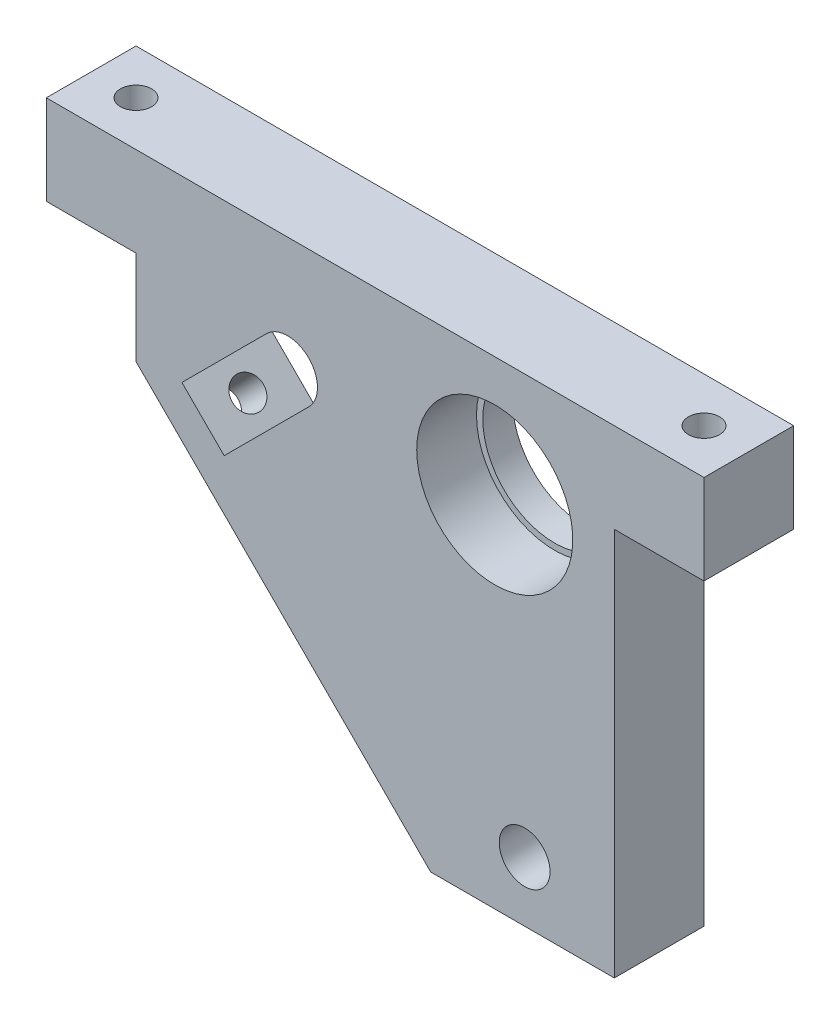
ISO-10303-21;
HEADER;
FILE_DESCRIPTION(('STEP AP214'),'2;1');
FILE_NAME('part.step','',(''),(''),'','','');
FILE_SCHEMA(('AUTOMOTIVE_DESIGN { 1 0 10303 214 1 1 1 1 }'));
ENDSEC;
DATA;
#1=APPLICATION_CONTEXT('core data for automotive mechanical design processes');
#2=APPLICATION_PROTOCOL_DEFINITION('international standard','automotive_design',2000,#1);
#3=PRODUCT_CONTEXT('',#1,'mechanical');
#4=PRODUCT('Part','Part','',(#3));
#5=PRODUCT_RELATED_PRODUCT_CATEGORY('part','',(#4));
#6=PRODUCT_DEFINITION_FORMATION('','',#4);
#7=PRODUCT_DEFINITION_CONTEXT('part definition',#1,'design');
#8=PRODUCT_DEFINITION('design','',#6,#7);
#9=PRODUCT_DEFINITION_SHAPE('','',#8);
#10=(LENGTH_UNIT() NAMED_UNIT(*) SI_UNIT(.MILLI.,.METRE.));
#11=(NAMED_UNIT(*) PLANE_ANGLE_UNIT() SI_UNIT($,.RADIAN.));
#12=(NAMED_UNIT(*) SI_UNIT($,.STERADIAN.) SOLID_ANGLE_UNIT());
#13=UNCERTAINTY_MEASURE_WITH_UNIT(LENGTH_MEASURE(1.E-05),#10,'distance_accuracy_value','');
#14=(GEOMETRIC_REPRESENTATION_CONTEXT(3) GLOBAL_UNCERTAINTY_ASSIGNED_CONTEXT((#13)) GLOBAL_UNIT_ASSIGNED_CONTEXT((#10,
#11,#12)) REPRESENTATION_CONTEXT('',''));
#15=CARTESIAN_POINT('',(0.,0.,0.));
#16=DIRECTION('',(0.,0.,1.));
#17=DIRECTION('',(1.,0.,0.));
#18=AXIS2_PLACEMENT_3D('',#15,#16,#17);
#19=CARTESIAN_POINT('',(0.,0.,15.));
#20=DIRECTION('',(0.,0.,1.));
#21=DIRECTION('',(1.,0.,0.));
#22=AXIS2_PLACEMENT_3D('',#19,#20,#21);
#23=PLANE('',#22);
#24=CARTESIAN_POINT('',(41.1990103270224,21.3834982788296,15.));
#25=DIRECTION('',(0.,0.,-1.));
#26=DIRECTION('',(-1.,0.,0.));
#27=AXIS2_PLACEMENT_3D('',#24,#25,#26);
#28=CIRCLE('',#27,13.05);
#29=CARTESIAN_POINT('',(28.1490103270224,21.3834982788296,15.));
#30=VERTEX_POINT('',#29);
#31=EDGE_CURVE('E241',#30,#30,#28,.T.);
#32=ORIENTED_EDGE('',*,*,#31,.T.);
#33=EDGE_LOOP('',(#32));
#34=FACE_BOUND('',#33,.T.);
#35=DIRECTION('',(0.707106781186548,0.707106781186547,0.));
#36=VECTOR('',#35,1.);
#37=CARTESIAN_POINT('',(-4.05582366891658,4.41293553035247,15.));
#38=LINE('',#37,#36);
#39=CARTESIAN_POINT('',(-4.05582366891658,4.41293553035247,15.));
#40=VERTEX_POINT('',#39);
#41=CARTESIAN_POINT('',(10.0863119548146,18.5550711540836,15.));
#42=VERTEX_POINT('',#41);
#43=EDGE_CURVE('E139',#40,#42,#38,.T.);
#44=ORIENTED_EDGE('',*,*,#43,.F.);
#45=DIRECTION('',(0.707106781186546,-0.707106781186549,0.));
#46=VECTOR('',#45,1.);
#47=CARTESIAN_POINT('',(-11.1268914807821,11.484003342218,15.));
#48=LINE('',#47,#46);
#49=CARTESIAN_POINT('',(-11.1268914807821,11.484003342218,15.));
#50=VERTEX_POINT('',#49);
#51=EDGE_CURVE('E131',#50,#40,#48,.T.);
#52=ORIENTED_EDGE('',*,*,#51,.F.);
#53=DIRECTION('',(-0.707106781186548,-0.707106781186547,0.));
#54=VECTOR('',#53,1.);
#55=CARTESIAN_POINT('',(-11.1268914807821,11.484003342218,15.));
#56=LINE('',#55,#54);
#57=CARTESIAN_POINT('',(3.01524414294889,25.6261389659489,15.));
#58=VERTEX_POINT('',#57);
#59=EDGE_CURVE('E154',#58,#50,#56,.T.);
#60=ORIENTED_EDGE('',*,*,#59,.F.);
#61=CARTESIAN_POINT('',(6.55077804888163,22.0906050600162,15.));
#62=DIRECTION('',(0.,0.,1.));
#63=DIRECTION('',(1.,0.,0.));
#64=AXIS2_PLACEMENT_3D('',#61,#62,#63);
#65=CIRCLE('',#64,5.00000000000001);
#66=EDGE_CURVE('E152',#42,#58,#65,.T.);
#67=ORIENTED_EDGE('',*,*,#66,.F.);
#68=EDGE_LOOP('',(#44,#52,#60,#67));
#69=FACE_BOUND('',#68,.T.);
#70=DIRECTION('',(0.,-1.,0.));
#71=VECTOR('',#70,1.);
#72=CARTESIAN_POINT('',(-33.8009896729777,41.3834982788296,15.));
#73=LINE('',#72,#71);
#74=CARTESIAN_POINT('',(-33.8009896729777,41.3834982788296,15.));
#75=VERTEX_POINT('',#74);
#76=CARTESIAN_POINT('',(-33.8009896729777,26.3834982788296,15.));
#77=VERTEX_POINT('',#76);
#78=EDGE_CURVE('E173',#75,#77,#73,.T.);
#79=ORIENTED_EDGE('',*,*,#78,.T.);
#80=DIRECTION('',(1.,0.,0.));
#81=VECTOR('',#80,1.);
#82=CARTESIAN_POINT('',(-33.8009896729777,26.3834982788296,15.));
#83=LINE('',#82,#81);
#84=CARTESIAN_POINT('',(-18.8009896729777,26.3834982788296,15.));
#85=VERTEX_POINT('',#84);
#86=EDGE_CURVE('E176',#77,#85,#83,.T.);
#87=ORIENTED_EDGE('',*,*,#86,.T.);
#88=DIRECTION('',(0.,-1.,0.));
#89=VECTOR('',#88,1.);
#90=CARTESIAN_POINT('',(-18.8009896729777,26.3834982788296,15.));
#91=LINE('',#90,#89);
#92=CARTESIAN_POINT('',(-18.8009896729777,10.672820160175,15.));
#93=VERTEX_POINT('',#92);
#94=EDGE_CURVE('E179',#85,#93,#91,.T.);
#95=ORIENTED_EDGE('',*,*,#94,.T.);
#96=DIRECTION('',(0.707106781186546,-0.707106781186549,0.));
#97=VECTOR('',#96,1.);
#98=CARTESIAN_POINT('',(-18.8009896729777,10.672820160175,15.));
#99=LINE('',#98,#97);
#100=CARTESIAN_POINT('',(30.4883322083676,-38.6165017211704,15.));
#101=VERTEX_POINT('',#100);
#102=EDGE_CURVE('E181',#93,#101,#99,.T.);
#103=ORIENTED_EDGE('',*,*,#102,.T.);
#104=DIRECTION('',(1.,0.,0.));
#105=VECTOR('',#104,1.);
#106=CARTESIAN_POINT('',(30.4883322083676,-38.6165017211704,15.));
#107=LINE('',#106,#105);
#108=CARTESIAN_POINT('',(61.1990103270224,-38.6165017211704,15.));
#109=VERTEX_POINT('',#108);
#110=EDGE_CURVE('E183',#101,#109,#107,.T.);
#111=ORIENTED_EDGE('',*,*,#110,.T.);
#112=DIRECTION('',(0.,1.,0.));
#113=VECTOR('',#112,1.);
#114=CARTESIAN_POINT('',(61.1990103270224,26.3834982788296,15.));
#115=LINE('',#114,#113);
#116=CARTESIAN_POINT('',(61.1990103270224,26.3834982788296,15.));
#117=VERTEX_POINT('',#116);
#118=EDGE_CURVE('E185',#109,#117,#115,.T.);
#119=ORIENTED_EDGE('',*,*,#118,.T.);
#120=DIRECTION('',(1.,0.,0.));
#121=VECTOR('',#120,1.);
#122=CARTESIAN_POINT('',(76.1990103270224,26.3834982788296,15.));
#123=LINE('',#122,#121);
#124=CARTESIAN_POINT('',(76.1990103270224,26.3834982788296,15.));
#125=VERTEX_POINT('',#124);
#126=EDGE_CURVE('E187',#117,#125,#123,.T.);
#127=ORIENTED_EDGE('',*,*,#126,.T.);
#128=DIRECTION('',(0.,1.,0.));
#129=VECTOR('',#128,1.);
#130=CARTESIAN_POINT('',(76.1990103270224,41.3834982788296,15.));
#131=LINE('',#130,#129);
#132=CARTESIAN_POINT('',(76.1990103270224,41.3834982788296,15.));
#133=VERTEX_POINT('',#132);
#134=EDGE_CURVE('E189',#125,#133,#131,.T.);
#135=ORIENTED_EDGE('',*,*,#134,.T.);
#136=DIRECTION('',(-1.,0.,0.));
#137=VECTOR('',#136,1.);
#138=CARTESIAN_POINT('',(56.1990103270223,41.3834982788296,15.));
#139=LINE('',#138,#137);
#140=EDGE_CURVE('E191',#133,#75,#139,.T.);
#141=ORIENTED_EDGE('',*,*,#140,.T.);
#142=EDGE_LOOP('',(#79,#87,#95,#103,#111,#119,#127,#135,#141));
#143=FACE_BOUND('',#142,.T.);
#144=CARTESIAN_POINT('',(46.1990103270224,-28.6165017211704,15.));
#145=DIRECTION('',(0.,0.,1.));
#146=DIRECTION('',(1.,0.,0.));
#147=AXIS2_PLACEMENT_3D('',#144,#145,#146);
#148=CIRCLE('',#147,4.25);
#149=CARTESIAN_POINT('',(50.4490103270224,-28.6165017211704,15.));
#150=VERTEX_POINT('',#149);
#151=EDGE_CURVE('E160',#150,#150,#148,.T.);
#152=ORIENTED_EDGE('',*,*,#151,.F.);
#153=EDGE_LOOP('',(#152));
#154=FACE_BOUND('',#153,.T.);
#155=ADVANCED_FACE('F34',(#34,#69,#143,#154),#23,.T.);
#156=CARTESIAN_POINT('',(0.,0.,0.));
#157=DIRECTION('',(0.,0.,1.));
#158=DIRECTION('',(1.,0.,0.));
#159=AXIS2_PLACEMENT_3D('',#156,#157,#158);
#160=PLANE('',#159);
#161=CARTESIAN_POINT('',(41.1990103270224,21.3834982788296,0.));
#162=DIRECTION('',(0.,0.,1.));
#163=DIRECTION('',(1.,0.,0.));
#164=AXIS2_PLACEMENT_3D('',#161,#162,#163);
#165=CIRCLE('',#164,12.);
#166=CARTESIAN_POINT('',(53.1990103270224,21.3834982788296,0.));
#167=VERTEX_POINT('',#166);
#168=EDGE_CURVE('E147',#167,#167,#165,.T.);
#169=ORIENTED_EDGE('',*,*,#168,.T.);
#170=EDGE_LOOP('',(#169));
#171=FACE_BOUND('',#170,.T.);
#172=DIRECTION('',(0.,-1.,0.));
#173=VECTOR('',#172,1.);
#174=CARTESIAN_POINT('',(-33.8009896729777,41.3834982788296,0.));
#175=LINE('',#174,#173);
#176=CARTESIAN_POINT('',(-33.8009896729777,41.3834982788296,0.));
#177=VERTEX_POINT('',#176);
#178=CARTESIAN_POINT('',(-33.8009896729777,26.3834982788296,0.));
#179=VERTEX_POINT('',#178);
#180=EDGE_CURVE('E172',#177,#179,#175,.T.);
#181=ORIENTED_EDGE('',*,*,#180,.F.);
#182=DIRECTION('',(-1.,0.,0.));
#183=VECTOR('',#182,1.);
#184=CARTESIAN_POINT('',(-33.8009896729777,41.3834982788296,0.));
#185=LINE('',#184,#183);
#186=CARTESIAN_POINT('',(76.1990103270224,41.3834982788296,0.));
#187=VERTEX_POINT('',#186);
#188=EDGE_CURVE('E177',#187,#177,#185,.T.);
#189=ORIENTED_EDGE('',*,*,#188,.F.);
#190=DIRECTION('',(0.,1.,0.));
#191=VECTOR('',#190,1.);
#192=CARTESIAN_POINT('',(76.1990103270224,41.3834982788296,0.));
#193=LINE('',#192,#191);
#194=CARTESIAN_POINT('',(76.1990103270224,26.3834982788296,0.));
#195=VERTEX_POINT('',#194);
#196=EDGE_CURVE('E208',#195,#187,#193,.T.);
#197=ORIENTED_EDGE('',*,*,#196,.F.);
#198=DIRECTION('',(1.,0.,0.));
#199=VECTOR('',#198,1.);
#200=CARTESIAN_POINT('',(76.1990103270224,26.3834982788296,0.));
#201=LINE('',#200,#199);
#202=CARTESIAN_POINT('',(61.1990103270224,26.3834982788296,0.));
#203=VERTEX_POINT('',#202);
#204=EDGE_CURVE('E206',#203,#195,#201,.T.);
#205=ORIENTED_EDGE('',*,*,#204,.F.);
#206=DIRECTION('',(0.,1.,0.));
#207=VECTOR('',#206,1.);
#208=CARTESIAN_POINT('',(61.1990103270224,26.3834982788296,0.));
#209=LINE('',#208,#207);
#210=CARTESIAN_POINT('',(61.1990103270224,-38.6165017211704,0.));
#211=VERTEX_POINT('',#210);
#212=EDGE_CURVE('E204',#211,#203,#209,.T.);
#213=ORIENTED_EDGE('',*,*,#212,.F.);
#214=DIRECTION('',(1.,0.,0.));
#215=VECTOR('',#214,1.);
#216=CARTESIAN_POINT('',(30.4883322083676,-38.6165017211704,0.));
#217=LINE('',#216,#215);
#218=CARTESIAN_POINT('',(30.4883322083676,-38.6165017211704,0.));
#219=VERTEX_POINT('',#218);
#220=EDGE_CURVE('E202',#219,#211,#217,.T.);
#221=ORIENTED_EDGE('',*,*,#220,.F.);
#222=DIRECTION('',(0.707106781186546,-0.707106781186549,0.));
#223=VECTOR('',#222,1.);
#224=CARTESIAN_POINT('',(-18.8009896729777,10.672820160175,0.));
#225=LINE('',#224,#223);
#226=CARTESIAN_POINT('',(-18.8009896729777,10.672820160175,0.));
#227=VERTEX_POINT('',#226);
#228=EDGE_CURVE('E200',#227,#219,#225,.T.);
#229=ORIENTED_EDGE('',*,*,#228,.F.);
#230=DIRECTION('',(0.,-1.,0.));
#231=VECTOR('',#230,1.);
#232=CARTESIAN_POINT('',(-18.8009896729777,26.3834982788296,0.));
#233=LINE('',#232,#231);
#234=CARTESIAN_POINT('',(-18.8009896729777,26.3834982788296,0.));
#235=VERTEX_POINT('',#234);
#236=EDGE_CURVE('E198',#235,#227,#233,.T.);
#237=ORIENTED_EDGE('',*,*,#236,.F.);
#238=DIRECTION('',(1.,0.,0.));
#239=VECTOR('',#238,1.);
#240=CARTESIAN_POINT('',(-27.4405999797669,26.3834982788296,0.));
#241=LINE('',#240,#239);
#242=EDGE_CURVE('E196',#179,#235,#241,.T.);
#243=ORIENTED_EDGE('',*,*,#242,.F.);
#244=EDGE_LOOP('',(#181,#189,#197,#205,#213,#221,#229,#237,#243));
#245=FACE_BOUND('',#244,.T.);
#246=DIRECTION('',(0.707106781186546,-0.707106781186549,0.));
#247=VECTOR('',#246,1.);
#248=CARTESIAN_POINT('',(-11.1268914807821,11.484003342218,0.));
#249=LINE('',#248,#247);
#250=CARTESIAN_POINT('',(-11.1268914807821,11.484003342218,0.));
#251=VERTEX_POINT('',#250);
#252=CARTESIAN_POINT('',(-4.05582366891658,4.41293553035247,0.));
#253=VERTEX_POINT('',#252);
#254=EDGE_CURVE('E59',#251,#253,#249,.T.);
#255=ORIENTED_EDGE('',*,*,#254,.T.);
#256=DIRECTION('',(0.707106781186548,0.707106781186547,0.));
#257=VECTOR('',#256,1.);
#258=CARTESIAN_POINT('',(-4.05582366891658,4.41293553035247,0.));
#259=LINE('',#258,#257);
#260=CARTESIAN_POINT('',(10.0863119548146,18.5550711540836,0.));
#261=VERTEX_POINT('',#260);
#262=EDGE_CURVE('E146',#253,#261,#259,.T.);
#263=ORIENTED_EDGE('',*,*,#262,.T.);
#264=CARTESIAN_POINT('',(6.55077804888163,22.0906050600162,0.));
#265=DIRECTION('',(0.,0.,1.));
#266=DIRECTION('',(1.,0.,0.));
#267=AXIS2_PLACEMENT_3D('',#264,#265,#266);
#268=CIRCLE('',#267,5.00000000000001);
#269=CARTESIAN_POINT('',(3.01524414294889,25.6261389659489,0.));
#270=VERTEX_POINT('',#269);
#271=EDGE_CURVE('E162',#261,#270,#268,.T.);
#272=ORIENTED_EDGE('',*,*,#271,.T.);
#273=DIRECTION('',(-0.707106781186548,-0.707106781186547,0.));
#274=VECTOR('',#273,1.);
#275=CARTESIAN_POINT('',(-11.1268914807821,11.484003342218,0.));
#276=LINE('',#275,#274);
#277=EDGE_CURVE('E140',#270,#251,#276,.T.);
#278=ORIENTED_EDGE('',*,*,#277,.T.);
#279=EDGE_LOOP('',(#255,#263,#272,#278));
#280=FACE_BOUND('',#279,.T.);
#281=CARTESIAN_POINT('',(46.1990103270224,-28.6165017211704,0.));
#282=DIRECTION('',(0.,0.,1.));
#283=DIRECTION('',(1.,0.,0.));
#284=AXIS2_PLACEMENT_3D('',#281,#282,#283);
#285=CIRCLE('',#284,4.25);
#286=CARTESIAN_POINT('',(50.4490103270224,-28.6165017211704,0.));
#287=VERTEX_POINT('',#286);
#288=EDGE_CURVE('E235',#287,#287,#285,.T.);
#289=ORIENTED_EDGE('',*,*,#288,.T.);
#290=EDGE_LOOP('',(#289));
#291=FACE_BOUND('',#290,.T.);
#292=ADVANCED_FACE('F258',(#171,#245,#280,#291),#160,.F.);
#293=CARTESIAN_POINT('',(-33.8009896729777,41.3834982788296,15.));
#294=DIRECTION('',(1.,0.,0.));
#295=DIRECTION('',(0.,1.,0.));
#296=AXIS2_PLACEMENT_3D('',#293,#294,#295);
#297=PLANE('',#296);
#298=ORIENTED_EDGE('',*,*,#180,.T.);
#299=DIRECTION('',(0.,0.,-1.));
#300=VECTOR('',#299,1.);
#301=CARTESIAN_POINT('',(-33.8009896729777,26.3834982788296,15.));
#302=LINE('',#301,#300);
#303=EDGE_CURVE('E11',#77,#179,#302,.T.);
#304=ORIENTED_EDGE('',*,*,#303,.F.);
#305=ORIENTED_EDGE('',*,*,#78,.F.);
#306=DIRECTION('',(0.,0.,-1.));
#307=VECTOR('',#306,1.);
#308=CARTESIAN_POINT('',(-33.8009896729777,41.3834982788296,15.));
#309=LINE('',#308,#307);
#310=EDGE_CURVE('E193',#75,#177,#309,.T.);
#311=ORIENTED_EDGE('',*,*,#310,.T.);
#312=EDGE_LOOP('',(#298,#304,#305,#311));
#313=FACE_BOUND('',#312,.T.);
#314=ADVANCED_FACE('F36',(#313),#297,.F.);
#315=CARTESIAN_POINT('',(-27.4405999797669,26.3834982788296,15.));
#316=DIRECTION('',(0.,1.,0.));
#317=DIRECTION('',(0.,0.,1.));
#318=AXIS2_PLACEMENT_3D('',#315,#316,#317);
#319=PLANE('',#318);
#320=CARTESIAN_POINT('',(-26.3009896729777,26.3834982788296,7.5));
#321=DIRECTION('',(0.,1.,0.));
#322=DIRECTION('',(0.,0.,1.));
#323=AXIS2_PLACEMENT_3D('',#320,#321,#322);
#324=CIRCLE('',#323,2.6);
#325=CARTESIAN_POINT('',(-26.3009896729777,26.3834982788296,10.1));
#326=VERTEX_POINT('',#325);
#327=EDGE_CURVE('E246',#326,#326,#324,.T.);
#328=ORIENTED_EDGE('',*,*,#327,.T.);
#329=EDGE_LOOP('',(#328));
#330=FACE_BOUND('',#329,.T.);
#331=ORIENTED_EDGE('',*,*,#242,.T.);
#332=DIRECTION('',(0.,0.,-1.));
#333=VECTOR('',#332,1.);
#334=CARTESIAN_POINT('',(-18.8009896729777,26.3834982788296,15.));
#335=LINE('',#334,#333);
#336=EDGE_CURVE('E43',#85,#235,#335,.T.);
#337=ORIENTED_EDGE('',*,*,#336,.F.);
#338=ORIENTED_EDGE('',*,*,#86,.F.);
#339=ORIENTED_EDGE('',*,*,#303,.T.);
#340=EDGE_LOOP('',(#331,#337,#338,#339));
#341=FACE_BOUND('',#340,.T.);
#342=ADVANCED_FACE('F296',(#330,#341),#319,.F.);
#343=CARTESIAN_POINT('',(-18.8009896729777,26.3834982788296,15.));
#344=DIRECTION('',(1.,0.,0.));
#345=DIRECTION('',(0.,1.,0.));
#346=AXIS2_PLACEMENT_3D('',#343,#344,#345);
#347=PLANE('',#346);
#348=ORIENTED_EDGE('',*,*,#236,.T.);
#349=DIRECTION('',(0.,0.,-1.));
#350=VECTOR('',#349,1.);
#351=CARTESIAN_POINT('',(-18.8009896729777,10.672820160175,15.));
#352=LINE('',#351,#350);
#353=EDGE_CURVE('E229',#93,#227,#352,.T.);
#354=ORIENTED_EDGE('',*,*,#353,.F.);
#355=ORIENTED_EDGE('',*,*,#94,.F.);
#356=ORIENTED_EDGE('',*,*,#336,.T.);
#357=EDGE_LOOP('',(#348,#354,#355,#356));
#358=FACE_BOUND('',#357,.T.);
#359=ADVANCED_FACE('F293',(#358),#347,.F.);
#360=CARTESIAN_POINT('',(-18.8009896729777,10.672820160175,15.));
#361=DIRECTION('',(0.707106781186549,0.707106781186546,0.));
#362=DIRECTION('',(-0.707106781186546,0.707106781186549,0.));
#363=AXIS2_PLACEMENT_3D('',#360,#361,#362);
#364=PLANE('',#363);
#365=CARTESIAN_POINT('',(-11.8359878782902,3.70781836548751,7.5));
#366=DIRECTION('',(-0.707106781186548,-0.707106781186547,0.));
#367=DIRECTION('',(0.707106781186547,-0.707106781186548,0.));
#368=AXIS2_PLACEMENT_3D('',#365,#366,#367);
#369=CIRCLE('',#368,2.6);
#370=CARTESIAN_POINT('',(-9.99751024720517,1.86934073440249,7.5));
#371=VERTEX_POINT('',#370);
#372=EDGE_CURVE('E366',#371,#371,#369,.T.);
#373=ORIENTED_EDGE('',*,*,#372,.F.);
#374=EDGE_LOOP('',(#373));
#375=FACE_BOUND('',#374,.T.);
#376=ORIENTED_EDGE('',*,*,#228,.T.);
#377=DIRECTION('',(0.,0.,-1.));
#378=VECTOR('',#377,1.);
#379=CARTESIAN_POINT('',(30.4883322083676,-38.6165017211704,15.));
#380=LINE('',#379,#378);
#381=EDGE_CURVE('E226',#101,#219,#380,.T.);
#382=ORIENTED_EDGE('',*,*,#381,.F.);
#383=ORIENTED_EDGE('',*,*,#102,.F.);
#384=ORIENTED_EDGE('',*,*,#353,.T.);
#385=EDGE_LOOP('',(#376,#382,#383,#384));
#386=FACE_BOUND('',#385,.T.);
#387=ADVANCED_FACE('F289',(#375,#386),#364,.F.);
#388=CARTESIAN_POINT('',(30.4883322083676,-38.6165017211704,15.));
#389=DIRECTION('',(0.,1.,0.));
#390=DIRECTION('',(-1.,0.,0.));
#391=AXIS2_PLACEMENT_3D('',#388,#389,#390);
#392=PLANE('',#391);
#393=ORIENTED_EDGE('',*,*,#220,.T.);
#394=DIRECTION('',(0.,0.,-1.));
#395=VECTOR('',#394,1.);
#396=CARTESIAN_POINT('',(61.1990103270224,-38.6165017211704,15.));
#397=LINE('',#396,#395);
#398=EDGE_CURVE('E223',#109,#211,#397,.T.);
#399=ORIENTED_EDGE('',*,*,#398,.F.);
#400=ORIENTED_EDGE('',*,*,#110,.F.);
#401=ORIENTED_EDGE('',*,*,#381,.T.);
#402=EDGE_LOOP('',(#393,#399,#400,#401));
#403=FACE_BOUND('',#402,.T.);
#404=ADVANCED_FACE('F285',(#403),#392,.F.);
#405=CARTESIAN_POINT('',(61.1990103270224,26.3834982788296,15.));
#406=DIRECTION('',(-1.,0.,0.));
#407=DIRECTION('',(0.,0.,1.));
#408=AXIS2_PLACEMENT_3D('',#405,#406,#407);
#409=PLANE('',#408);
#410=ORIENTED_EDGE('',*,*,#212,.T.);
#411=DIRECTION('',(0.,0.,-1.));
#412=VECTOR('',#411,1.);
#413=CARTESIAN_POINT('',(61.1990103270224,26.3834982788296,15.));
#414=LINE('',#413,#412);
#415=EDGE_CURVE('E220',#117,#203,#414,.T.);
#416=ORIENTED_EDGE('',*,*,#415,.F.);
#417=ORIENTED_EDGE('',*,*,#118,.F.);
#418=ORIENTED_EDGE('',*,*,#398,.T.);
#419=EDGE_LOOP('',(#410,#416,#417,#418));
#420=FACE_BOUND('',#419,.T.);
#421=ADVANCED_FACE('F281',(#420),#409,.F.);
#422=CARTESIAN_POINT('',(76.1990103270224,26.3834982788296,15.));
#423=DIRECTION('',(0.,1.,0.));
#424=DIRECTION('',(-1.,0.,0.));
#425=AXIS2_PLACEMENT_3D('',#422,#423,#424);
#426=PLANE('',#425);
#427=CARTESIAN_POINT('',(68.6990103270224,26.3834982788296,7.5));
#428=DIRECTION('',(0.,1.,0.));
#429=DIRECTION('',(-1.,0.,0.));
#430=AXIS2_PLACEMENT_3D('',#427,#428,#429);
#431=CIRCLE('',#430,2.6);
#432=CARTESIAN_POINT('',(66.0990103270224,26.3834982788296,7.5));
#433=VERTEX_POINT('',#432);
#434=EDGE_CURVE('E376',#433,#433,#431,.T.);
#435=ORIENTED_EDGE('',*,*,#434,.T.);
#436=EDGE_LOOP('',(#435));
#437=FACE_BOUND('',#436,.T.);
#438=ORIENTED_EDGE('',*,*,#204,.T.);
#439=DIRECTION('',(0.,0.,-1.));
#440=VECTOR('',#439,1.);
#441=CARTESIAN_POINT('',(76.1990103270224,26.3834982788296,15.));
#442=LINE('',#441,#440);
#443=EDGE_CURVE('E217',#125,#195,#442,.T.);
#444=ORIENTED_EDGE('',*,*,#443,.F.);
#445=ORIENTED_EDGE('',*,*,#126,.F.);
#446=ORIENTED_EDGE('',*,*,#415,.T.);
#447=EDGE_LOOP('',(#438,#444,#445,#446));
#448=FACE_BOUND('',#447,.T.);
#449=ADVANCED_FACE('F277',(#437,#448),#426,.F.);
#450=CARTESIAN_POINT('',(76.1990103270224,41.3834982788296,15.));
#451=DIRECTION('',(-1.,0.,0.));
#452=DIRECTION('',(0.,0.,1.));
#453=AXIS2_PLACEMENT_3D('',#450,#451,#452);
#454=PLANE('',#453);
#455=ORIENTED_EDGE('',*,*,#196,.T.);
#456=DIRECTION('',(0.,0.,-1.));
#457=VECTOR('',#456,1.);
#458=CARTESIAN_POINT('',(76.1990103270224,41.3834982788296,15.));
#459=LINE('',#458,#457);
#460=EDGE_CURVE('E214',#133,#187,#459,.T.);
#461=ORIENTED_EDGE('',*,*,#460,.F.);
#462=ORIENTED_EDGE('',*,*,#134,.F.);
#463=ORIENTED_EDGE('',*,*,#443,.T.);
#464=EDGE_LOOP('',(#455,#461,#462,#463));
#465=FACE_BOUND('',#464,.T.);
#466=ADVANCED_FACE('F273',(#465),#454,.F.);
#467=CARTESIAN_POINT('',(-33.8009896729777,41.3834982788296,15.));
#468=DIRECTION('',(0.,-1.,0.));
#469=DIRECTION('',(0.,0.,-1.));
#470=AXIS2_PLACEMENT_3D('',#467,#468,#469);
#471=PLANE('',#470);
#472=CARTESIAN_POINT('',(-26.3009896729777,41.3834982788296,7.5));
#473=DIRECTION('',(0.,1.,0.));
#474=DIRECTION('',(0.,0.,1.));
#475=AXIS2_PLACEMENT_3D('',#472,#473,#474);
#476=CIRCLE('',#475,2.6);
#477=CARTESIAN_POINT('',(-26.3009896729777,41.3834982788296,10.1));
#478=VERTEX_POINT('',#477);
#479=EDGE_CURVE('E368',#478,#478,#476,.T.);
#480=ORIENTED_EDGE('',*,*,#479,.F.);
#481=EDGE_LOOP('',(#480));
#482=FACE_BOUND('',#481,.T.);
#483=CARTESIAN_POINT('',(68.6990103270224,41.3834982788296,7.5));
#484=DIRECTION('',(0.,1.,0.));
#485=DIRECTION('',(0.,0.,1.));
#486=AXIS2_PLACEMENT_3D('',#483,#484,#485);
#487=CIRCLE('',#486,2.6);
#488=CARTESIAN_POINT('',(68.6990103270224,41.3834982788296,10.1));
#489=VERTEX_POINT('',#488);
#490=EDGE_CURVE('E365',#489,#489,#487,.T.);
#491=ORIENTED_EDGE('',*,*,#490,.F.);
#492=EDGE_LOOP('',(#491));
#493=FACE_BOUND('',#492,.T.);
#494=ORIENTED_EDGE('',*,*,#188,.T.);
#495=ORIENTED_EDGE('',*,*,#310,.F.);
#496=ORIENTED_EDGE('',*,*,#140,.F.);
#497=ORIENTED_EDGE('',*,*,#460,.T.);
#498=EDGE_LOOP('',(#494,#495,#496,#497));
#499=FACE_BOUND('',#498,.T.);
#500=ADVANCED_FACE('F270',(#482,#493,#499),#471,.F.);
#501=CARTESIAN_POINT('',(41.1990103270224,21.3834982788296,15.));
#502=DIRECTION('',(0.,0.,-1.));
#503=DIRECTION('',(-1.,0.,0.));
#504=AXIS2_PLACEMENT_3D('',#501,#502,#503);
#505=CYLINDRICAL_SURFACE('',#504,12.);
#506=CARTESIAN_POINT('',(41.1990103270224,21.3834982788296,5.));
#507=DIRECTION('',(0.,0.,-1.));
#508=DIRECTION('',(-1.,0.,0.));
#509=AXIS2_PLACEMENT_3D('',#506,#507,#508);
#510=CIRCLE('',#509,12.);
#511=CARTESIAN_POINT('',(29.1990103270224,21.3834982788296,5.));
#512=VERTEX_POINT('',#511);
#513=EDGE_CURVE('E233',#512,#512,#510,.T.);
#514=ORIENTED_EDGE('',*,*,#513,.F.);
#515=EDGE_LOOP('',(#514));
#516=FACE_BOUND('',#515,.T.);
#517=ORIENTED_EDGE('',*,*,#168,.F.);
#518=EDGE_LOOP('',(#517));
#519=FACE_BOUND('',#518,.T.);
#520=ADVANCED_FACE('F267',(#516,#519),#505,.F.);
#521=CARTESIAN_POINT('',(-11.1268914807821,11.484003342218,15.));
#522=DIRECTION('',(0.707106781186549,0.707106781186546,0.));
#523=DIRECTION('',(-0.707106781186546,0.707106781186549,0.));
#524=AXIS2_PLACEMENT_3D('',#521,#522,#523);
#525=PLANE('',#524);
#526=CARTESIAN_POINT('',(-7.5933471911709,7.9504590526068,7.5));
#527=DIRECTION('',(0.707106781186549,0.707106781186546,0.));
#528=DIRECTION('',(-0.707106781186546,0.707106781186549,0.));
#529=AXIS2_PLACEMENT_3D('',#526,#527,#528);
#530=CIRCLE('',#529,2.6);
#531=CARTESIAN_POINT('',(-9.43182482225592,9.78893668369182,7.5));
#532=VERTEX_POINT('',#531);
#533=EDGE_CURVE('E38',#532,#532,#530,.T.);
#534=ORIENTED_EDGE('',*,*,#533,.F.);
#535=EDGE_LOOP('',(#534));
#536=FACE_BOUND('',#535,.T.);
#537=ORIENTED_EDGE('',*,*,#254,.F.);
#538=DIRECTION('',(0.,0.,-1.));
#539=VECTOR('',#538,1.);
#540=CARTESIAN_POINT('',(-11.1268914807821,11.484003342218,15.));
#541=LINE('',#540,#539);
#542=EDGE_CURVE('E135',#50,#251,#541,.T.);
#543=ORIENTED_EDGE('',*,*,#542,.F.);
#544=ORIENTED_EDGE('',*,*,#51,.T.);
#545=DIRECTION('',(0.,0.,-1.));
#546=VECTOR('',#545,1.);
#547=CARTESIAN_POINT('',(-4.05582366891658,4.41293553035247,15.));
#548=LINE('',#547,#546);
#549=EDGE_CURVE('E134',#40,#253,#548,.T.);
#550=ORIENTED_EDGE('',*,*,#549,.T.);
#551=EDGE_LOOP('',(#537,#543,#544,#550));
#552=FACE_BOUND('',#551,.T.);
#553=ADVANCED_FACE('F133',(#536,#552),#525,.T.);
#554=CARTESIAN_POINT('',(-4.05582366891658,4.41293553035247,15.));
#555=DIRECTION('',(-0.707106781186547,0.707106781186548,0.));
#556=DIRECTION('',(-0.707106781186548,-0.707106781186547,0.));
#557=AXIS2_PLACEMENT_3D('',#554,#555,#556);
#558=PLANE('',#557);
#559=ORIENTED_EDGE('',*,*,#262,.F.);
#560=ORIENTED_EDGE('',*,*,#549,.F.);
#561=ORIENTED_EDGE('',*,*,#43,.T.);
#562=DIRECTION('',(0.,0.,-1.));
#563=VECTOR('',#562,1.);
#564=CARTESIAN_POINT('',(10.0863119548146,18.5550711540836,15.));
#565=LINE('',#564,#563);
#566=EDGE_CURVE('E148',#42,#261,#565,.T.);
#567=ORIENTED_EDGE('',*,*,#566,.T.);
#568=EDGE_LOOP('',(#559,#560,#561,#567));
#569=FACE_BOUND('',#568,.T.);
#570=ADVANCED_FACE('F143',(#569),#558,.T.);
#571=CARTESIAN_POINT('',(6.55077804888163,22.0906050600162,15.));
#572=DIRECTION('',(0.,0.,-1.));
#573=DIRECTION('',(-1.,0.,0.));
#574=AXIS2_PLACEMENT_3D('',#571,#572,#573);
#575=CYLINDRICAL_SURFACE('',#574,5.00000000000001);
#576=ORIENTED_EDGE('',*,*,#271,.F.);
#577=ORIENTED_EDGE('',*,*,#566,.F.);
#578=ORIENTED_EDGE('',*,*,#66,.T.);
#579=DIRECTION('',(0.,0.,-1.));
#580=VECTOR('',#579,1.);
#581=CARTESIAN_POINT('',(3.01524414294889,25.6261389659489,15.));
#582=LINE('',#581,#580);
#583=EDGE_CURVE('E51',#58,#270,#582,.T.);
#584=ORIENTED_EDGE('',*,*,#583,.T.);
#585=EDGE_LOOP('',(#576,#577,#578,#584));
#586=FACE_BOUND('',#585,.T.);
#587=ADVANCED_FACE('F348',(#586),#575,.F.);
#588=CARTESIAN_POINT('',(-11.1268914807821,11.484003342218,15.));
#589=DIRECTION('',(0.707106781186547,-0.707106781186548,0.));
#590=DIRECTION('',(0.707106781186548,0.707106781186547,0.));
#591=AXIS2_PLACEMENT_3D('',#588,#589,#590);
#592=PLANE('',#591);
#593=ORIENTED_EDGE('',*,*,#277,.F.);
#594=ORIENTED_EDGE('',*,*,#583,.F.);
#595=ORIENTED_EDGE('',*,*,#59,.T.);
#596=ORIENTED_EDGE('',*,*,#542,.T.);
#597=EDGE_LOOP('',(#593,#594,#595,#596));
#598=FACE_BOUND('',#597,.T.);
#599=ADVANCED_FACE('F340',(#598),#592,.T.);
#600=CARTESIAN_POINT('',(46.1990103270224,-28.6165017211704,15.));
#601=DIRECTION('',(0.,0.,-1.));
#602=DIRECTION('',(-1.,0.,0.));
#603=AXIS2_PLACEMENT_3D('',#600,#601,#602);
#604=CYLINDRICAL_SURFACE('',#603,4.25);
#605=ORIENTED_EDGE('',*,*,#151,.T.);
#606=EDGE_LOOP('',(#605));
#607=FACE_BOUND('',#606,.T.);
#608=ORIENTED_EDGE('',*,*,#288,.F.);
#609=EDGE_LOOP('',(#608));
#610=FACE_BOUND('',#609,.T.);
#611=ADVANCED_FACE('F254',(#607,#610),#604,.F.);
#612=CARTESIAN_POINT('',(41.1990103270224,21.3834982788296,5.));
#613=DIRECTION('',(0.,0.,1.));
#614=DIRECTION('',(1.,0.,0.));
#615=AXIS2_PLACEMENT_3D('',#612,#613,#614);
#616=CYLINDRICAL_SURFACE('',#615,13.05);
#617=CARTESIAN_POINT('',(41.1990103270224,21.3834982788296,5.));
#618=DIRECTION('',(0.,0.,-1.));
#619=DIRECTION('',(-1.,0.,0.));
#620=AXIS2_PLACEMENT_3D('',#617,#618,#619);
#621=CIRCLE('',#620,13.05);
#622=CARTESIAN_POINT('',(28.1490103270224,21.3834982788296,5.));
#623=VERTEX_POINT('',#622);
#624=EDGE_CURVE('E236',#623,#623,#621,.T.);
#625=ORIENTED_EDGE('',*,*,#624,.T.);
#626=EDGE_LOOP('',(#625));
#627=FACE_BOUND('',#626,.T.);
#628=ORIENTED_EDGE('',*,*,#31,.F.);
#629=EDGE_LOOP('',(#628));
#630=FACE_BOUND('',#629,.T.);
#631=ADVANCED_FACE('F339',(#627,#630),#616,.F.);
#632=CARTESIAN_POINT('',(41.1990103270224,21.3834982788296,5.));
#633=DIRECTION('',(0.,0.,-1.));
#634=DIRECTION('',(-1.,0.,0.));
#635=AXIS2_PLACEMENT_3D('',#632,#633,#634);
#636=PLANE('',#635);
#637=ORIENTED_EDGE('',*,*,#513,.T.);
#638=EDGE_LOOP('',(#637));
#639=FACE_BOUND('',#638,.T.);
#640=ORIENTED_EDGE('',*,*,#624,.F.);
#641=EDGE_LOOP('',(#640));
#642=FACE_BOUND('',#641,.T.);
#643=ADVANCED_FACE('F346',(#639,#642),#636,.F.);
#644=CARTESIAN_POINT('',(68.6990103270224,-38.6165017211704,7.5));
#645=DIRECTION('',(0.,1.,0.));
#646=DIRECTION('',(0.,0.,1.));
#647=AXIS2_PLACEMENT_3D('',#644,#645,#646);
#648=CYLINDRICAL_SURFACE('',#647,2.6);
#649=ORIENTED_EDGE('',*,*,#490,.T.);
#650=EDGE_LOOP('',(#649));
#651=FACE_BOUND('',#650,.T.);
#652=ORIENTED_EDGE('',*,*,#434,.F.);
#653=EDGE_LOOP('',(#652));
#654=FACE_BOUND('',#653,.T.);
#655=ADVANCED_FACE('F380',(#651,#654),#648,.F.);
#656=CARTESIAN_POINT('',(-26.3009896729777,-38.6165017211704,7.5));
#657=DIRECTION('',(0.,1.,0.));
#658=DIRECTION('',(0.,0.,1.));
#659=AXIS2_PLACEMENT_3D('',#656,#657,#658);
#660=CYLINDRICAL_SURFACE('',#659,2.6);
#661=ORIENTED_EDGE('',*,*,#479,.T.);
#662=EDGE_LOOP('',(#661));
#663=FACE_BOUND('',#662,.T.);
#664=ORIENTED_EDGE('',*,*,#327,.F.);
#665=EDGE_LOOP('',(#664));
#666=FACE_BOUND('',#665,.T.);
#667=ADVANCED_FACE('F382',(#663,#666),#660,.F.);
#668=CARTESIAN_POINT('',(-4.76492006642471,10.778886177353,7.5));
#669=DIRECTION('',(-0.707106781186548,-0.707106781186547,0.));
#670=DIRECTION('',(0.707106781186547,-0.707106781186548,0.));
#671=AXIS2_PLACEMENT_3D('',#668,#669,#670);
#672=CYLINDRICAL_SURFACE('',#671,2.6);
#673=ORIENTED_EDGE('',*,*,#533,.T.);
#674=EDGE_LOOP('',(#673));
#675=FACE_BOUND('',#674,.T.);
#676=ORIENTED_EDGE('',*,*,#372,.T.);
#677=EDGE_LOOP('',(#676));
#678=FACE_BOUND('',#677,.T.);
#679=ADVANCED_FACE('F389',(#675,#678),#672,.F.);
#680=CLOSED_SHELL('',(#155,#292,#314,#342,#359,#387,#404,#421,#449,#466,#500,#520,#553,#570,
#587,#599,#611,#631,#643,#655,#667,#679));
#681=MANIFOLD_SOLID_BREP('B2',#680);
#682=ADVANCED_BREP_SHAPE_REPRESENTATION('',(#18,#681),#14);
#683=SHAPE_DEFINITION_REPRESENTATION(#9,#682);
ENDSEC;
END-ISO-10303-21;
